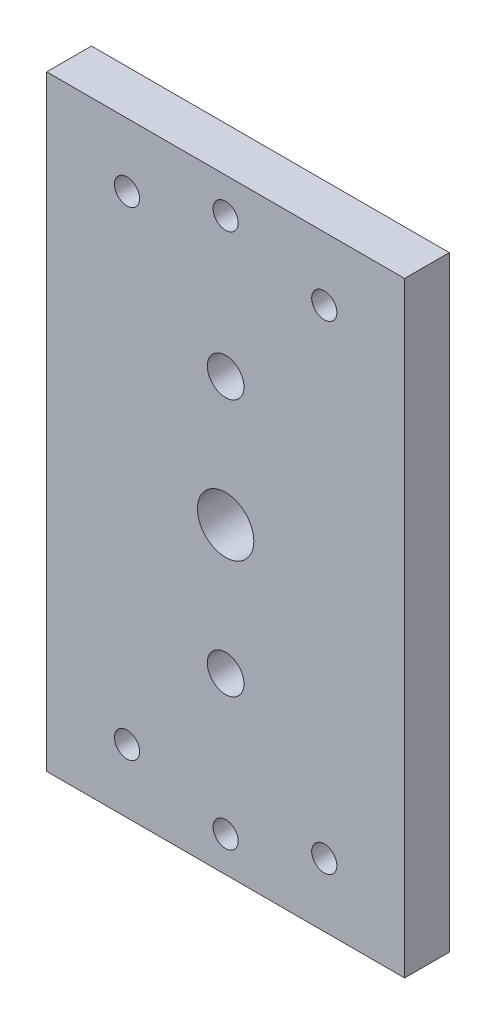
ISO-10303-21;
HEADER;
FILE_DESCRIPTION(('STEP AP214'),'2;1');
FILE_NAME('part.step','',(''),(''),'','','');
FILE_SCHEMA(('AUTOMOTIVE_DESIGN { 1 0 10303 214 1 1 1 1 }'));
ENDSEC;
DATA;
#1=APPLICATION_CONTEXT('core data for automotive mechanical design processes');
#2=APPLICATION_PROTOCOL_DEFINITION('international standard','automotive_design',2000,#1);
#3=PRODUCT_CONTEXT('',#1,'mechanical');
#4=PRODUCT('Part','Part','',(#3));
#5=PRODUCT_RELATED_PRODUCT_CATEGORY('part','',(#4));
#6=PRODUCT_DEFINITION_FORMATION('','',#4);
#7=PRODUCT_DEFINITION_CONTEXT('part definition',#1,'design');
#8=PRODUCT_DEFINITION('design','',#6,#7);
#9=PRODUCT_DEFINITION_SHAPE('','',#8);
#10=(LENGTH_UNIT() NAMED_UNIT(*) SI_UNIT(.MILLI.,.METRE.));
#11=(NAMED_UNIT(*) PLANE_ANGLE_UNIT() SI_UNIT($,.RADIAN.));
#12=(NAMED_UNIT(*) SI_UNIT($,.STERADIAN.) SOLID_ANGLE_UNIT());
#13=UNCERTAINTY_MEASURE_WITH_UNIT(LENGTH_MEASURE(1.E-05),#10,'distance_accuracy_value','');
#14=(GEOMETRIC_REPRESENTATION_CONTEXT(3) GLOBAL_UNCERTAINTY_ASSIGNED_CONTEXT((#13)) GLOBAL_UNIT_ASSIGNED_CONTEXT((#10,
#11,#12)) REPRESENTATION_CONTEXT('',''));
#15=CARTESIAN_POINT('',(0.,0.,0.));
#16=DIRECTION('',(0.,0.,1.));
#17=DIRECTION('',(1.,0.,0.));
#18=AXIS2_PLACEMENT_3D('',#15,#16,#17);
#19=CARTESIAN_POINT('',(0.,0.,6.35));
#20=DIRECTION('',(1.,0.,0.));
#21=DIRECTION('',(0.,0.,-1.));
#22=AXIS2_PLACEMENT_3D('',#19,#20,#21);
#23=PLANE('',#22);
#24=DIRECTION('',(0.,-1.,0.));
#25=VECTOR('',#24,1.);
#26=CARTESIAN_POINT('',(0.,0.,0.));
#27=LINE('',#26,#25);
#28=CARTESIAN_POINT('',(0.,86.,0.));
#29=VERTEX_POINT('',#28);
#30=CARTESIAN_POINT('',(0.,0.,0.));
#31=VERTEX_POINT('',#30);
#32=EDGE_CURVE('E97',#29,#31,#27,.T.);
#33=ORIENTED_EDGE('',*,*,#32,.T.);
#34=DIRECTION('',(0.,0.,-1.));
#35=VECTOR('',#34,1.);
#36=CARTESIAN_POINT('',(0.,0.,6.35));
#37=LINE('',#36,#35);
#38=CARTESIAN_POINT('',(0.,0.,6.35));
#39=VERTEX_POINT('',#38);
#40=EDGE_CURVE('E11',#39,#31,#37,.T.);
#41=ORIENTED_EDGE('',*,*,#40,.F.);
#42=DIRECTION('',(0.,-1.,0.));
#43=VECTOR('',#42,1.);
#44=CARTESIAN_POINT('',(0.,0.,6.35));
#45=LINE('',#44,#43);
#46=CARTESIAN_POINT('',(0.,86.,6.35));
#47=VERTEX_POINT('',#46);
#48=EDGE_CURVE('E85',#47,#39,#45,.T.);
#49=ORIENTED_EDGE('',*,*,#48,.F.);
#50=DIRECTION('',(0.,0.,-1.));
#51=VECTOR('',#50,1.);
#52=CARTESIAN_POINT('',(0.,86.,6.35));
#53=LINE('',#52,#51);
#54=EDGE_CURVE('E93',#47,#29,#53,.T.);
#55=ORIENTED_EDGE('',*,*,#54,.T.);
#56=EDGE_LOOP('',(#33,#41,#49,#55));
#57=FACE_BOUND('',#56,.T.);
#58=ADVANCED_FACE('F34',(#57),#23,.F.);
#59=CARTESIAN_POINT('',(0.,0.,6.35));
#60=DIRECTION('',(0.,1.,0.));
#61=DIRECTION('',(0.,0.,1.));
#62=AXIS2_PLACEMENT_3D('',#59,#60,#61);
#63=PLANE('',#62);
#64=DIRECTION('',(1.,0.,0.));
#65=VECTOR('',#64,1.);
#66=CARTESIAN_POINT('',(0.,0.,0.));
#67=LINE('',#66,#65);
#68=CARTESIAN_POINT('',(50.8,0.,0.));
#69=VERTEX_POINT('',#68);
#70=EDGE_CURVE('E89',#31,#69,#67,.T.);
#71=ORIENTED_EDGE('',*,*,#70,.T.);
#72=DIRECTION('',(0.,0.,-1.));
#73=VECTOR('',#72,1.);
#74=CARTESIAN_POINT('',(50.8,0.,6.35));
#75=LINE('',#74,#73);
#76=CARTESIAN_POINT('',(50.8,0.,6.35));
#77=VERTEX_POINT('',#76);
#78=EDGE_CURVE('E42',#77,#69,#75,.T.);
#79=ORIENTED_EDGE('',*,*,#78,.F.);
#80=DIRECTION('',(1.,0.,0.));
#81=VECTOR('',#80,1.);
#82=CARTESIAN_POINT('',(0.,0.,6.35));
#83=LINE('',#82,#81);
#84=EDGE_CURVE('E80',#39,#77,#83,.T.);
#85=ORIENTED_EDGE('',*,*,#84,.F.);
#86=ORIENTED_EDGE('',*,*,#40,.T.);
#87=EDGE_LOOP('',(#71,#79,#85,#86));
#88=FACE_BOUND('',#87,.T.);
#89=ADVANCED_FACE('F88',(#88),#63,.F.);
#90=CARTESIAN_POINT('',(50.8,0.,6.35));
#91=DIRECTION('',(-1.,0.,0.));
#92=DIRECTION('',(0.,0.,1.));
#93=AXIS2_PLACEMENT_3D('',#90,#91,#92);
#94=PLANE('',#93);
#95=DIRECTION('',(0.,1.,0.));
#96=VECTOR('',#95,1.);
#97=CARTESIAN_POINT('',(50.8,0.,0.));
#98=LINE('',#97,#96);
#99=CARTESIAN_POINT('',(50.8,86.,0.));
#100=VERTEX_POINT('',#99);
#101=EDGE_CURVE('E67',#69,#100,#98,.T.);
#102=ORIENTED_EDGE('',*,*,#101,.T.);
#103=DIRECTION('',(0.,0.,-1.));
#104=VECTOR('',#103,1.);
#105=CARTESIAN_POINT('',(50.8,86.,6.35));
#106=LINE('',#105,#104);
#107=CARTESIAN_POINT('',(50.8,86.,6.35));
#108=VERTEX_POINT('',#107);
#109=EDGE_CURVE('E90',#108,#100,#106,.T.);
#110=ORIENTED_EDGE('',*,*,#109,.F.);
#111=DIRECTION('',(0.,1.,0.));
#112=VECTOR('',#111,1.);
#113=CARTESIAN_POINT('',(50.8,0.,6.35));
#114=LINE('',#113,#112);
#115=EDGE_CURVE('E83',#77,#108,#114,.T.);
#116=ORIENTED_EDGE('',*,*,#115,.F.);
#117=ORIENTED_EDGE('',*,*,#78,.T.);
#118=EDGE_LOOP('',(#102,#110,#116,#117));
#119=FACE_BOUND('',#118,.T.);
#120=ADVANCED_FACE('F91',(#119),#94,.F.);
#121=CARTESIAN_POINT('',(0.,86.,6.35));
#122=DIRECTION('',(0.,-1.,0.));
#123=DIRECTION('',(0.,0.,-1.));
#124=AXIS2_PLACEMENT_3D('',#121,#122,#123);
#125=PLANE('',#124);
#126=DIRECTION('',(-1.,0.,0.));
#127=VECTOR('',#126,1.);
#128=CARTESIAN_POINT('',(0.,86.,0.));
#129=LINE('',#128,#127);
#130=EDGE_CURVE('E73',#100,#29,#129,.T.);
#131=ORIENTED_EDGE('',*,*,#130,.T.);
#132=ORIENTED_EDGE('',*,*,#54,.F.);
#133=DIRECTION('',(-1.,0.,0.));
#134=VECTOR('',#133,1.);
#135=CARTESIAN_POINT('',(0.,86.,6.35));
#136=LINE('',#135,#134);
#137=EDGE_CURVE('E50',#108,#47,#136,.T.);
#138=ORIENTED_EDGE('',*,*,#137,.F.);
#139=ORIENTED_EDGE('',*,*,#109,.T.);
#140=EDGE_LOOP('',(#131,#132,#138,#139));
#141=FACE_BOUND('',#140,.T.);
#142=ADVANCED_FACE('F105',(#141),#125,.F.);
#143=CARTESIAN_POINT('',(0.,0.,6.35));
#144=DIRECTION('',(0.,0.,-1.));
#145=DIRECTION('',(-1.,0.,0.));
#146=AXIS2_PLACEMENT_3D('',#143,#144,#145);
#147=PLANE('',#146);
#148=CARTESIAN_POINT('',(25.4,81.,6.35));
#149=DIRECTION('',(0.,0.,1.));
#150=DIRECTION('',(1.,0.,0.));
#151=AXIS2_PLACEMENT_3D('',#148,#149,#150);
#152=CIRCLE('',#151,1.785);
#153=CARTESIAN_POINT('',(27.185,81.,6.35));
#154=VERTEX_POINT('',#153);
#155=EDGE_CURVE('E159',#154,#154,#152,.T.);
#156=ORIENTED_EDGE('',*,*,#155,.F.);
#157=EDGE_LOOP('',(#156));
#158=FACE_BOUND('',#157,.T.);
#159=CARTESIAN_POINT('',(11.4,77.,6.35));
#160=DIRECTION('',(0.,0.,1.));
#161=DIRECTION('',(1.,0.,0.));
#162=AXIS2_PLACEMENT_3D('',#159,#160,#161);
#163=CIRCLE('',#162,1.785);
#164=CARTESIAN_POINT('',(13.185,77.,6.35));
#165=VERTEX_POINT('',#164);
#166=EDGE_CURVE('E153',#165,#165,#163,.T.);
#167=ORIENTED_EDGE('',*,*,#166,.F.);
#168=EDGE_LOOP('',(#167));
#169=FACE_BOUND('',#168,.T.);
#170=CARTESIAN_POINT('',(39.4,77.,6.35));
#171=DIRECTION('',(0.,0.,1.));
#172=DIRECTION('',(1.,0.,0.));
#173=AXIS2_PLACEMENT_3D('',#170,#171,#172);
#174=CIRCLE('',#173,1.785);
#175=CARTESIAN_POINT('',(41.185,77.,6.35));
#176=VERTEX_POINT('',#175);
#177=EDGE_CURVE('E147',#176,#176,#174,.T.);
#178=ORIENTED_EDGE('',*,*,#177,.F.);
#179=EDGE_LOOP('',(#178));
#180=FACE_BOUND('',#179,.T.);
#181=CARTESIAN_POINT('',(39.4,9.00000000000001,6.35));
#182=DIRECTION('',(0.,0.,1.));
#183=DIRECTION('',(-1.,0.,0.));
#184=AXIS2_PLACEMENT_3D('',#181,#182,#183);
#185=CIRCLE('',#184,1.785);
#186=CARTESIAN_POINT('',(37.615,9.00000000000001,6.35));
#187=VERTEX_POINT('',#186);
#188=EDGE_CURVE('E141',#187,#187,#185,.T.);
#189=ORIENTED_EDGE('',*,*,#188,.F.);
#190=EDGE_LOOP('',(#189));
#191=FACE_BOUND('',#190,.T.);
#192=CARTESIAN_POINT('',(11.4,9.00000000000001,6.35));
#193=DIRECTION('',(0.,0.,1.));
#194=DIRECTION('',(-1.,0.,0.));
#195=AXIS2_PLACEMENT_3D('',#192,#193,#194);
#196=CIRCLE('',#195,1.785);
#197=CARTESIAN_POINT('',(9.615,9.00000000000001,6.35));
#198=VERTEX_POINT('',#197);
#199=EDGE_CURVE('E135',#198,#198,#196,.T.);
#200=ORIENTED_EDGE('',*,*,#199,.F.);
#201=EDGE_LOOP('',(#200));
#202=FACE_BOUND('',#201,.T.);
#203=CARTESIAN_POINT('',(25.4,5.,6.35));
#204=DIRECTION('',(0.,0.,1.));
#205=DIRECTION('',(-1.,0.,0.));
#206=AXIS2_PLACEMENT_3D('',#203,#204,#205);
#207=CIRCLE('',#206,1.785);
#208=CARTESIAN_POINT('',(23.615,5.,6.35));
#209=VERTEX_POINT('',#208);
#210=EDGE_CURVE('E129',#209,#209,#207,.T.);
#211=ORIENTED_EDGE('',*,*,#210,.F.);
#212=EDGE_LOOP('',(#211));
#213=FACE_BOUND('',#212,.T.);
#214=CARTESIAN_POINT('',(25.4,24.75,6.35));
#215=DIRECTION('',(0.,0.,1.));
#216=DIRECTION('',(1.,0.,0.));
#217=AXIS2_PLACEMENT_3D('',#214,#215,#216);
#218=CIRCLE('',#217,2.6);
#219=CARTESIAN_POINT('',(28.,24.75,6.35));
#220=VERTEX_POINT('',#219);
#221=EDGE_CURVE('E117',#220,#220,#218,.T.);
#222=ORIENTED_EDGE('',*,*,#221,.F.);
#223=EDGE_LOOP('',(#222));
#224=FACE_BOUND('',#223,.T.);
#225=CARTESIAN_POINT('',(25.4,61.25,6.35));
#226=DIRECTION('',(0.,0.,1.));
#227=DIRECTION('',(1.,0.,0.));
#228=AXIS2_PLACEMENT_3D('',#225,#226,#227);
#229=CIRCLE('',#228,2.6);
#230=CARTESIAN_POINT('',(28.,61.25,6.35));
#231=VERTEX_POINT('',#230);
#232=EDGE_CURVE('E124',#231,#231,#229,.T.);
#233=ORIENTED_EDGE('',*,*,#232,.F.);
#234=EDGE_LOOP('',(#233));
#235=FACE_BOUND('',#234,.T.);
#236=CARTESIAN_POINT('',(25.4,43.,6.35));
#237=DIRECTION('',(0.,0.,1.));
#238=DIRECTION('',(1.,0.,0.));
#239=AXIS2_PLACEMENT_3D('',#236,#237,#238);
#240=CIRCLE('',#239,4.);
#241=CARTESIAN_POINT('',(29.4,43.,6.35));
#242=VERTEX_POINT('',#241);
#243=EDGE_CURVE('E111',#242,#242,#240,.T.);
#244=ORIENTED_EDGE('',*,*,#243,.F.);
#245=EDGE_LOOP('',(#244));
#246=FACE_BOUND('',#245,.T.);
#247=ORIENTED_EDGE('',*,*,#48,.T.);
#248=ORIENTED_EDGE('',*,*,#84,.T.);
#249=ORIENTED_EDGE('',*,*,#115,.T.);
#250=ORIENTED_EDGE('',*,*,#137,.T.);
#251=EDGE_LOOP('',(#247,#248,#249,#250));
#252=FACE_BOUND('',#251,.T.);
#253=ADVANCED_FACE('F81',(#158,#169,#180,#191,#202,#213,#224,#235,#246,#252),#147,.F.);
#254=CARTESIAN_POINT('',(0.,0.,0.));
#255=DIRECTION('',(0.,0.,-1.));
#256=DIRECTION('',(-1.,0.,0.));
#257=AXIS2_PLACEMENT_3D('',#254,#255,#256);
#258=PLANE('',#257);
#259=CARTESIAN_POINT('',(25.4,81.,0.));
#260=DIRECTION('',(0.,0.,1.));
#261=DIRECTION('',(1.,0.,0.));
#262=AXIS2_PLACEMENT_3D('',#259,#260,#261);
#263=CIRCLE('',#262,1.785);
#264=CARTESIAN_POINT('',(27.185,81.,0.));
#265=VERTEX_POINT('',#264);
#266=EDGE_CURVE('E121',#265,#265,#263,.T.);
#267=ORIENTED_EDGE('',*,*,#266,.T.);
#268=EDGE_LOOP('',(#267));
#269=FACE_BOUND('',#268,.T.);
#270=CARTESIAN_POINT('',(11.4,77.,0.));
#271=DIRECTION('',(0.,0.,1.));
#272=DIRECTION('',(1.,0.,0.));
#273=AXIS2_PLACEMENT_3D('',#270,#271,#272);
#274=CIRCLE('',#273,1.785);
#275=CARTESIAN_POINT('',(13.185,77.,0.));
#276=VERTEX_POINT('',#275);
#277=EDGE_CURVE('E156',#276,#276,#274,.T.);
#278=ORIENTED_EDGE('',*,*,#277,.T.);
#279=EDGE_LOOP('',(#278));
#280=FACE_BOUND('',#279,.T.);
#281=CARTESIAN_POINT('',(39.4,77.,0.));
#282=DIRECTION('',(0.,0.,1.));
#283=DIRECTION('',(1.,0.,0.));
#284=AXIS2_PLACEMENT_3D('',#281,#282,#283);
#285=CIRCLE('',#284,1.785);
#286=CARTESIAN_POINT('',(41.185,77.,0.));
#287=VERTEX_POINT('',#286);
#288=EDGE_CURVE('E150',#287,#287,#285,.T.);
#289=ORIENTED_EDGE('',*,*,#288,.T.);
#290=EDGE_LOOP('',(#289));
#291=FACE_BOUND('',#290,.T.);
#292=CARTESIAN_POINT('',(39.4,9.00000000000001,0.));
#293=DIRECTION('',(0.,0.,1.));
#294=DIRECTION('',(-1.,0.,0.));
#295=AXIS2_PLACEMENT_3D('',#292,#293,#294);
#296=CIRCLE('',#295,1.785);
#297=CARTESIAN_POINT('',(37.615,9.00000000000001,0.));
#298=VERTEX_POINT('',#297);
#299=EDGE_CURVE('E144',#298,#298,#296,.T.);
#300=ORIENTED_EDGE('',*,*,#299,.T.);
#301=EDGE_LOOP('',(#300));
#302=FACE_BOUND('',#301,.T.);
#303=CARTESIAN_POINT('',(11.4,9.00000000000001,0.));
#304=DIRECTION('',(0.,0.,1.));
#305=DIRECTION('',(-1.,0.,0.));
#306=AXIS2_PLACEMENT_3D('',#303,#304,#305);
#307=CIRCLE('',#306,1.785);
#308=CARTESIAN_POINT('',(9.615,9.00000000000001,0.));
#309=VERTEX_POINT('',#308);
#310=EDGE_CURVE('E138',#309,#309,#307,.T.);
#311=ORIENTED_EDGE('',*,*,#310,.T.);
#312=EDGE_LOOP('',(#311));
#313=FACE_BOUND('',#312,.T.);
#314=CARTESIAN_POINT('',(25.4,5.,0.));
#315=DIRECTION('',(0.,0.,1.));
#316=DIRECTION('',(-1.,0.,0.));
#317=AXIS2_PLACEMENT_3D('',#314,#315,#316);
#318=CIRCLE('',#317,1.785);
#319=CARTESIAN_POINT('',(23.615,5.,0.));
#320=VERTEX_POINT('',#319);
#321=EDGE_CURVE('E132',#320,#320,#318,.T.);
#322=ORIENTED_EDGE('',*,*,#321,.T.);
#323=EDGE_LOOP('',(#322));
#324=FACE_BOUND('',#323,.T.);
#325=CARTESIAN_POINT('',(25.4,24.75,0.));
#326=DIRECTION('',(0.,0.,1.));
#327=DIRECTION('',(1.,0.,0.));
#328=AXIS2_PLACEMENT_3D('',#325,#326,#327);
#329=CIRCLE('',#328,2.6);
#330=CARTESIAN_POINT('',(28.,24.75,0.));
#331=VERTEX_POINT('',#330);
#332=EDGE_CURVE('E120',#331,#331,#329,.T.);
#333=ORIENTED_EDGE('',*,*,#332,.T.);
#334=EDGE_LOOP('',(#333));
#335=FACE_BOUND('',#334,.T.);
#336=CARTESIAN_POINT('',(25.4,61.25,0.));
#337=DIRECTION('',(0.,0.,1.));
#338=DIRECTION('',(1.,0.,0.));
#339=AXIS2_PLACEMENT_3D('',#336,#337,#338);
#340=CIRCLE('',#339,2.6);
#341=CARTESIAN_POINT('',(28.,61.25,0.));
#342=VERTEX_POINT('',#341);
#343=EDGE_CURVE('E114',#342,#342,#340,.T.);
#344=ORIENTED_EDGE('',*,*,#343,.T.);
#345=EDGE_LOOP('',(#344));
#346=FACE_BOUND('',#345,.T.);
#347=CARTESIAN_POINT('',(25.4,43.,0.));
#348=DIRECTION('',(0.,0.,1.));
#349=DIRECTION('',(1.,0.,0.));
#350=AXIS2_PLACEMENT_3D('',#347,#348,#349);
#351=CIRCLE('',#350,4.);
#352=CARTESIAN_POINT('',(29.4,43.,0.));
#353=VERTEX_POINT('',#352);
#354=EDGE_CURVE('E100',#353,#353,#351,.T.);
#355=ORIENTED_EDGE('',*,*,#354,.T.);
#356=EDGE_LOOP('',(#355));
#357=FACE_BOUND('',#356,.T.);
#358=ORIENTED_EDGE('',*,*,#32,.F.);
#359=ORIENTED_EDGE('',*,*,#130,.F.);
#360=ORIENTED_EDGE('',*,*,#101,.F.);
#361=ORIENTED_EDGE('',*,*,#70,.F.);
#362=EDGE_LOOP('',(#358,#359,#360,#361));
#363=FACE_BOUND('',#362,.T.);
#364=ADVANCED_FACE('F108',(#269,#280,#291,#302,#313,#324,#335,#346,#357,#363),#258,.T.);
#365=CARTESIAN_POINT('',(25.4,43.,0.));
#366=DIRECTION('',(0.,0.,1.));
#367=DIRECTION('',(1.,0.,0.));
#368=AXIS2_PLACEMENT_3D('',#365,#366,#367);
#369=CYLINDRICAL_SURFACE('',#368,4.);
#370=ORIENTED_EDGE('',*,*,#354,.F.);
#371=EDGE_LOOP('',(#370));
#372=FACE_BOUND('',#371,.T.);
#373=ORIENTED_EDGE('',*,*,#243,.T.);
#374=EDGE_LOOP('',(#373));
#375=FACE_BOUND('',#374,.T.);
#376=ADVANCED_FACE('F193',(#372,#375),#369,.F.);
#377=CARTESIAN_POINT('',(25.4,61.25,0.));
#378=DIRECTION('',(0.,0.,1.));
#379=DIRECTION('',(1.,0.,0.));
#380=AXIS2_PLACEMENT_3D('',#377,#378,#379);
#381=CYLINDRICAL_SURFACE('',#380,2.6);
#382=ORIENTED_EDGE('',*,*,#343,.F.);
#383=EDGE_LOOP('',(#382));
#384=FACE_BOUND('',#383,.T.);
#385=ORIENTED_EDGE('',*,*,#232,.T.);
#386=EDGE_LOOP('',(#385));
#387=FACE_BOUND('',#386,.T.);
#388=ADVANCED_FACE('F195',(#384,#387),#381,.F.);
#389=CARTESIAN_POINT('',(25.4,24.75,0.));
#390=DIRECTION('',(0.,0.,1.));
#391=DIRECTION('',(1.,0.,0.));
#392=AXIS2_PLACEMENT_3D('',#389,#390,#391);
#393=CYLINDRICAL_SURFACE('',#392,2.6);
#394=ORIENTED_EDGE('',*,*,#332,.F.);
#395=EDGE_LOOP('',(#394));
#396=FACE_BOUND('',#395,.T.);
#397=ORIENTED_EDGE('',*,*,#221,.T.);
#398=EDGE_LOOP('',(#397));
#399=FACE_BOUND('',#398,.T.);
#400=ADVANCED_FACE('F202',(#396,#399),#393,.F.);
#401=CARTESIAN_POINT('',(25.4,5.,0.));
#402=DIRECTION('',(0.,0.,1.));
#403=DIRECTION('',(1.,0.,0.));
#404=AXIS2_PLACEMENT_3D('',#401,#402,#403);
#405=CYLINDRICAL_SURFACE('',#404,1.785);
#406=ORIENTED_EDGE('',*,*,#321,.F.);
#407=EDGE_LOOP('',(#406));
#408=FACE_BOUND('',#407,.T.);
#409=ORIENTED_EDGE('',*,*,#210,.T.);
#410=EDGE_LOOP('',(#409));
#411=FACE_BOUND('',#410,.T.);
#412=ADVANCED_FACE('F237',(#408,#411),#405,.F.);
#413=CARTESIAN_POINT('',(11.4,9.00000000000001,0.));
#414=DIRECTION('',(0.,0.,1.));
#415=DIRECTION('',(1.,0.,0.));
#416=AXIS2_PLACEMENT_3D('',#413,#414,#415);
#417=CYLINDRICAL_SURFACE('',#416,1.785);
#418=ORIENTED_EDGE('',*,*,#310,.F.);
#419=EDGE_LOOP('',(#418));
#420=FACE_BOUND('',#419,.T.);
#421=ORIENTED_EDGE('',*,*,#199,.T.);
#422=EDGE_LOOP('',(#421));
#423=FACE_BOUND('',#422,.T.);
#424=ADVANCED_FACE('F242',(#420,#423),#417,.F.);
#425=CARTESIAN_POINT('',(39.4,9.00000000000001,0.));
#426=DIRECTION('',(0.,0.,1.));
#427=DIRECTION('',(1.,0.,0.));
#428=AXIS2_PLACEMENT_3D('',#425,#426,#427);
#429=CYLINDRICAL_SURFACE('',#428,1.785);
#430=ORIENTED_EDGE('',*,*,#299,.F.);
#431=EDGE_LOOP('',(#430));
#432=FACE_BOUND('',#431,.T.);
#433=ORIENTED_EDGE('',*,*,#188,.T.);
#434=EDGE_LOOP('',(#433));
#435=FACE_BOUND('',#434,.T.);
#436=ADVANCED_FACE('F254',(#432,#435),#429,.F.);
#437=CARTESIAN_POINT('',(39.4,77.,0.));
#438=DIRECTION('',(0.,0.,1.));
#439=DIRECTION('',(1.,0.,0.));
#440=AXIS2_PLACEMENT_3D('',#437,#438,#439);
#441=CYLINDRICAL_SURFACE('',#440,1.785);
#442=ORIENTED_EDGE('',*,*,#288,.F.);
#443=EDGE_LOOP('',(#442));
#444=FACE_BOUND('',#443,.T.);
#445=ORIENTED_EDGE('',*,*,#177,.T.);
#446=EDGE_LOOP('',(#445));
#447=FACE_BOUND('',#446,.T.);
#448=ADVANCED_FACE('F264',(#444,#447),#441,.F.);
#449=CARTESIAN_POINT('',(11.4,77.,0.));
#450=DIRECTION('',(0.,0.,1.));
#451=DIRECTION('',(1.,0.,0.));
#452=AXIS2_PLACEMENT_3D('',#449,#450,#451);
#453=CYLINDRICAL_SURFACE('',#452,1.785);
#454=ORIENTED_EDGE('',*,*,#277,.F.);
#455=EDGE_LOOP('',(#454));
#456=FACE_BOUND('',#455,.T.);
#457=ORIENTED_EDGE('',*,*,#166,.T.);
#458=EDGE_LOOP('',(#457));
#459=FACE_BOUND('',#458,.T.);
#460=ADVANCED_FACE('F170',(#456,#459),#453,.F.);
#461=CARTESIAN_POINT('',(25.4,81.,0.));
#462=DIRECTION('',(0.,0.,1.));
#463=DIRECTION('',(1.,0.,0.));
#464=AXIS2_PLACEMENT_3D('',#461,#462,#463);
#465=CYLINDRICAL_SURFACE('',#464,1.785);
#466=ORIENTED_EDGE('',*,*,#266,.F.);
#467=EDGE_LOOP('',(#466));
#468=FACE_BOUND('',#467,.T.);
#469=ORIENTED_EDGE('',*,*,#155,.T.);
#470=EDGE_LOOP('',(#469));
#471=FACE_BOUND('',#470,.T.);
#472=ADVANCED_FACE('F167',(#468,#471),#465,.F.);
#473=CLOSED_SHELL('',(#58,#89,#120,#142,#253,#364,#376,#388,#400,#412,#424,#436,#448,#460,#472));
#474=MANIFOLD_SOLID_BREP('B2',#473);
#475=ADVANCED_BREP_SHAPE_REPRESENTATION('',(#18,#474),#14);
#476=SHAPE_DEFINITION_REPRESENTATION(#9,#475);
ENDSEC;
END-ISO-10303-21;
